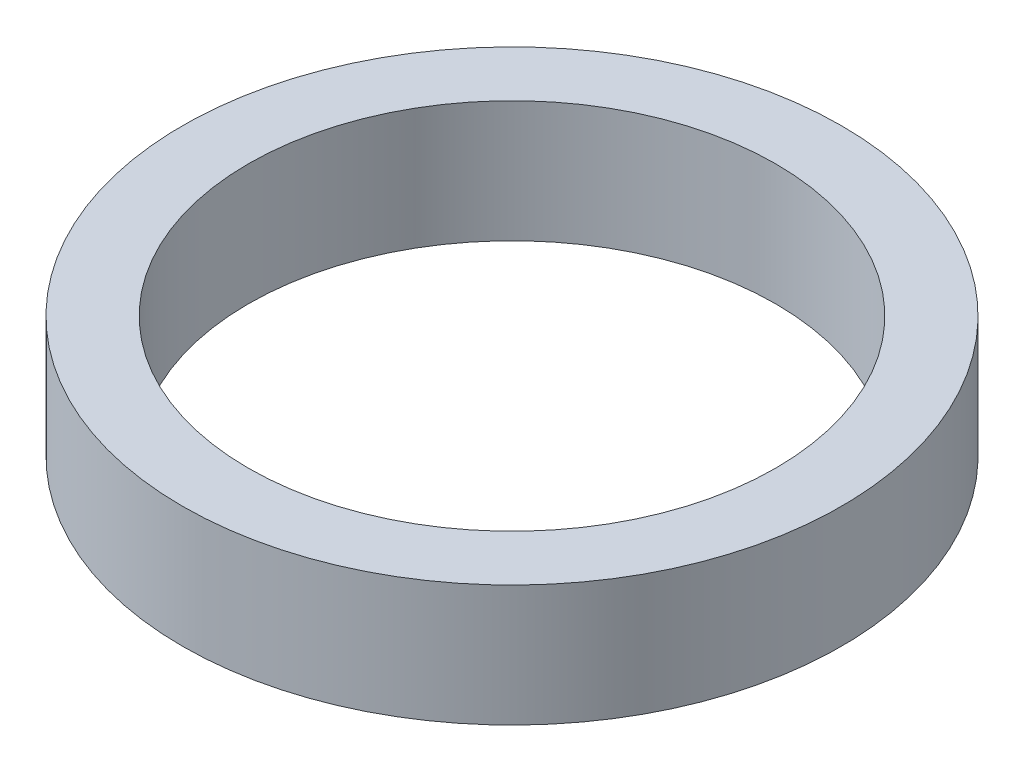
ISO-10303-21;
HEADER;
FILE_DESCRIPTION(('STEP AP214'),'2;1');
FILE_NAME('part.step','',(''),(''),'','','');
FILE_SCHEMA(('AUTOMOTIVE_DESIGN { 1 0 10303 214 1 1 1 1 }'));
ENDSEC;
DATA;
#1=APPLICATION_CONTEXT('core data for automotive mechanical design processes');
#2=APPLICATION_PROTOCOL_DEFINITION('international standard','automotive_design',2000,#1);
#3=PRODUCT_CONTEXT('',#1,'mechanical');
#4=PRODUCT('Part','Part','',(#3));
#5=PRODUCT_RELATED_PRODUCT_CATEGORY('part','',(#4));
#6=PRODUCT_DEFINITION_FORMATION('','',#4);
#7=PRODUCT_DEFINITION_CONTEXT('part definition',#1,'design');
#8=PRODUCT_DEFINITION('design','',#6,#7);
#9=PRODUCT_DEFINITION_SHAPE('','',#8);
#10=(LENGTH_UNIT() NAMED_UNIT(*) SI_UNIT(.MILLI.,.METRE.));
#11=(NAMED_UNIT(*) PLANE_ANGLE_UNIT() SI_UNIT($,.RADIAN.));
#12=(NAMED_UNIT(*) SI_UNIT($,.STERADIAN.) SOLID_ANGLE_UNIT());
#13=UNCERTAINTY_MEASURE_WITH_UNIT(LENGTH_MEASURE(1.E-05),#10,'distance_accuracy_value','');
#14=(GEOMETRIC_REPRESENTATION_CONTEXT(3) GLOBAL_UNCERTAINTY_ASSIGNED_CONTEXT((#13)) GLOBAL_UNIT_ASSIGNED_CONTEXT((#10,
#11,#12)) REPRESENTATION_CONTEXT('',''));
#15=CARTESIAN_POINT('',(0.,0.,0.));
#16=DIRECTION('',(0.,0.,1.));
#17=DIRECTION('',(1.,0.,0.));
#18=AXIS2_PLACEMENT_3D('',#15,#16,#17);
#19=CARTESIAN_POINT('',(0.,23.,0.));
#20=DIRECTION('',(0.,-1.,0.));
#21=DIRECTION('',(0.,0.,-1.));
#22=AXIS2_PLACEMENT_3D('',#19,#20,#21);
#23=CYLINDRICAL_SURFACE('',#22,62.5);
#24=CARTESIAN_POINT('',(0.,23.,0.));
#25=DIRECTION('',(0.,1.,0.));
#26=DIRECTION('',(0.,0.,1.));
#27=AXIS2_PLACEMENT_3D('',#24,#25,#26);
#28=CIRCLE('',#27,62.5);
#29=CARTESIAN_POINT('',(0.,23.,62.5));
#30=VERTEX_POINT('',#29);
#31=EDGE_CURVE('E10',#30,#30,#28,.T.);
#32=ORIENTED_EDGE('',*,*,#31,.F.);
#33=EDGE_LOOP('',(#32));
#34=FACE_BOUND('',#33,.T.);
#35=CARTESIAN_POINT('',(0.,0.,0.));
#36=DIRECTION('',(0.,1.,0.));
#37=DIRECTION('',(0.,0.,1.));
#38=AXIS2_PLACEMENT_3D('',#35,#36,#37);
#39=CIRCLE('',#38,62.5);
#40=CARTESIAN_POINT('',(0.,0.,62.5));
#41=VERTEX_POINT('',#40);
#42=EDGE_CURVE('E37',#41,#41,#39,.T.);
#43=ORIENTED_EDGE('',*,*,#42,.T.);
#44=EDGE_LOOP('',(#43));
#45=FACE_BOUND('',#44,.T.);
#46=ADVANCED_FACE('F40',(#34,#45),#23,.T.);
#47=CARTESIAN_POINT('',(0.,23.,0.));
#48=DIRECTION('',(0.,1.,0.));
#49=DIRECTION('',(0.,0.,1.));
#50=AXIS2_PLACEMENT_3D('',#47,#48,#49);
#51=PLANE('',#50);
#52=CARTESIAN_POINT('',(0.,23.,0.));
#53=DIRECTION('',(0.,1.,0.));
#54=DIRECTION('',(0.,0.,1.));
#55=AXIS2_PLACEMENT_3D('',#52,#53,#54);
#56=CIRCLE('',#55,50.);
#57=CARTESIAN_POINT('',(0.,23.,50.));
#58=VERTEX_POINT('',#57);
#59=EDGE_CURVE('E50',#58,#58,#56,.T.);
#60=ORIENTED_EDGE('',*,*,#59,.F.);
#61=EDGE_LOOP('',(#60));
#62=FACE_BOUND('',#61,.T.);
#63=ORIENTED_EDGE('',*,*,#31,.T.);
#64=EDGE_LOOP('',(#63));
#65=FACE_BOUND('',#64,.T.);
#66=ADVANCED_FACE('F59',(#62,#65),#51,.T.);
#67=CARTESIAN_POINT('',(0.,0.,0.));
#68=DIRECTION('',(0.,1.,0.));
#69=DIRECTION('',(0.,0.,1.));
#70=AXIS2_PLACEMENT_3D('',#67,#68,#69);
#71=PLANE('',#70);
#72=CARTESIAN_POINT('',(0.,0.,0.));
#73=DIRECTION('',(0.,1.,0.));
#74=DIRECTION('',(0.,0.,1.));
#75=AXIS2_PLACEMENT_3D('',#72,#73,#74);
#76=CIRCLE('',#75,50.);
#77=CARTESIAN_POINT('',(0.,0.,50.));
#78=VERTEX_POINT('',#77);
#79=EDGE_CURVE('E47',#78,#78,#76,.T.);
#80=ORIENTED_EDGE('',*,*,#79,.T.);
#81=EDGE_LOOP('',(#80));
#82=FACE_BOUND('',#81,.T.);
#83=ORIENTED_EDGE('',*,*,#42,.F.);
#84=EDGE_LOOP('',(#83));
#85=FACE_BOUND('',#84,.T.);
#86=ADVANCED_FACE('F58',(#82,#85),#71,.F.);
#87=CARTESIAN_POINT('',(0.,23.,0.));
#88=DIRECTION('',(0.,-1.,0.));
#89=DIRECTION('',(0.,0.,-1.));
#90=AXIS2_PLACEMENT_3D('',#87,#88,#89);
#91=CYLINDRICAL_SURFACE('',#90,50.);
#92=ORIENTED_EDGE('',*,*,#59,.T.);
#93=EDGE_LOOP('',(#92));
#94=FACE_BOUND('',#93,.T.);
#95=ORIENTED_EDGE('',*,*,#79,.F.);
#96=EDGE_LOOP('',(#95));
#97=FACE_BOUND('',#96,.T.);
#98=ADVANCED_FACE('F54',(#94,#97),#91,.F.);
#99=CLOSED_SHELL('',(#46,#66,#86,#98));
#100=MANIFOLD_SOLID_BREP('B2',#99);
#101=ADVANCED_BREP_SHAPE_REPRESENTATION('',(#18,#100),#14);
#102=SHAPE_DEFINITION_REPRESENTATION(#9,#101);
ENDSEC;
END-ISO-10303-21;
